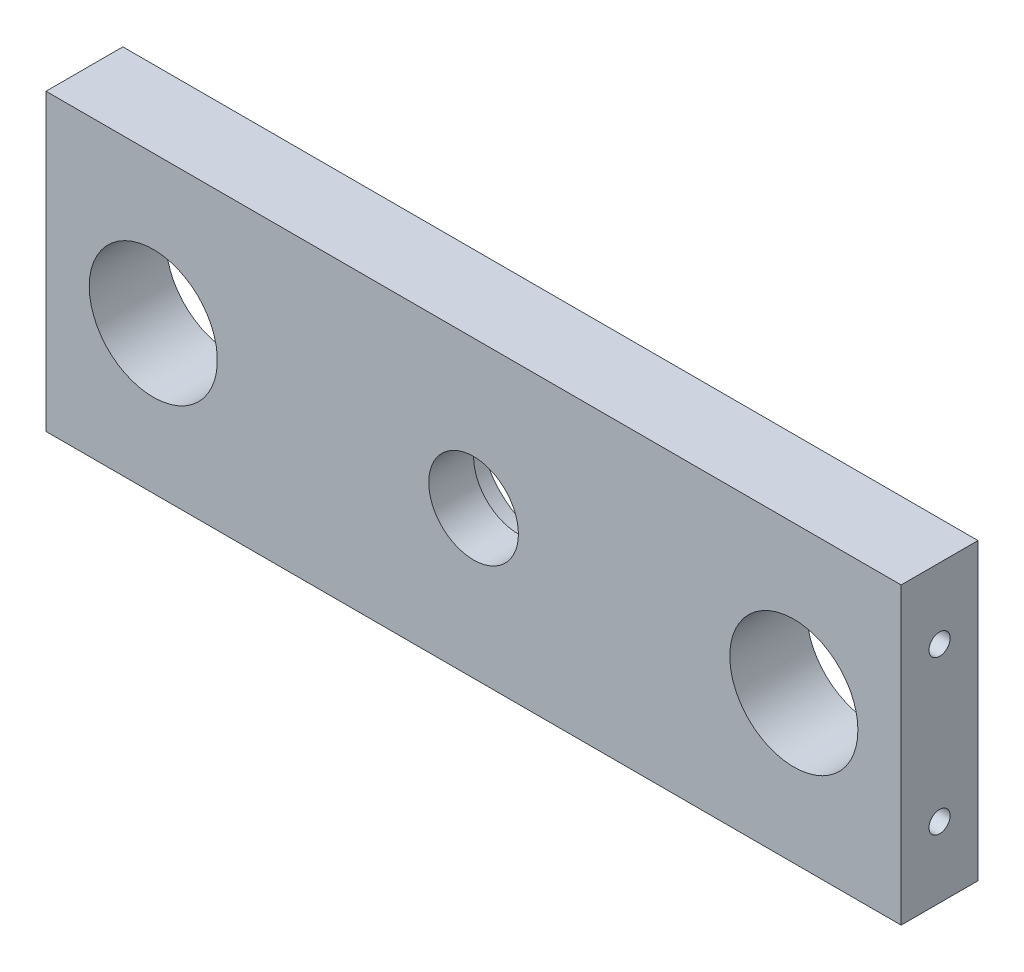
ISO-10303-21;
HEADER;
FILE_DESCRIPTION(('STEP AP214'),'2;1');
FILE_NAME('part.step','',(''),(''),'','','');
FILE_SCHEMA(('AUTOMOTIVE_DESIGN { 1 0 10303 214 1 1 1 1 }'));
ENDSEC;
DATA;
#1=APPLICATION_CONTEXT('core data for automotive mechanical design processes');
#2=APPLICATION_PROTOCOL_DEFINITION('international standard','automotive_design',2000,#1);
#3=PRODUCT_CONTEXT('',#1,'mechanical');
#4=PRODUCT('Part','Part','',(#3));
#5=PRODUCT_RELATED_PRODUCT_CATEGORY('part','',(#4));
#6=PRODUCT_DEFINITION_FORMATION('','',#4);
#7=PRODUCT_DEFINITION_CONTEXT('part definition',#1,'design');
#8=PRODUCT_DEFINITION('design','',#6,#7);
#9=PRODUCT_DEFINITION_SHAPE('','',#8);
#10=(LENGTH_UNIT() NAMED_UNIT(*) SI_UNIT(.MILLI.,.METRE.));
#11=(NAMED_UNIT(*) PLANE_ANGLE_UNIT() SI_UNIT($,.RADIAN.));
#12=(NAMED_UNIT(*) SI_UNIT($,.STERADIAN.) SOLID_ANGLE_UNIT());
#13=UNCERTAINTY_MEASURE_WITH_UNIT(LENGTH_MEASURE(1.E-05),#10,'distance_accuracy_value','');
#14=(GEOMETRIC_REPRESENTATION_CONTEXT(3) GLOBAL_UNCERTAINTY_ASSIGNED_CONTEXT((#13)) GLOBAL_UNIT_ASSIGNED_CONTEXT((#10,
#11,#12)) REPRESENTATION_CONTEXT('',''));
#15=CARTESIAN_POINT('',(0.,0.,0.));
#16=DIRECTION('',(0.,0.,1.));
#17=DIRECTION('',(1.,0.,0.));
#18=AXIS2_PLACEMENT_3D('',#15,#16,#17);
#19=CARTESIAN_POINT('',(0.,0.,12.));
#20=DIRECTION('',(0.,0.,-1.));
#21=DIRECTION('',(-1.,0.,0.));
#22=AXIS2_PLACEMENT_3D('',#19,#20,#21);
#23=CYLINDRICAL_SURFACE('',#22,7.);
#24=CARTESIAN_POINT('',(0.,0.,12.));
#25=DIRECTION('',(0.,0.,1.));
#26=DIRECTION('',(1.,0.,0.));
#27=AXIS2_PLACEMENT_3D('',#24,#25,#26);
#28=CIRCLE('',#27,7.);
#29=CARTESIAN_POINT('',(7.,0.,12.));
#30=VERTEX_POINT('',#29);
#31=EDGE_CURVE('E120',#30,#30,#28,.T.);
#32=ORIENTED_EDGE('',*,*,#31,.T.);
#33=EDGE_LOOP('',(#32));
#34=FACE_BOUND('',#33,.T.);
#35=CARTESIAN_POINT('',(0.,0.,5.));
#36=DIRECTION('',(0.,0.,-1.));
#37=DIRECTION('',(-1.,0.,0.));
#38=AXIS2_PLACEMENT_3D('',#35,#36,#37);
#39=CIRCLE('',#38,7.);
#40=CARTESIAN_POINT('',(-7.,0.,5.));
#41=VERTEX_POINT('',#40);
#42=EDGE_CURVE('E113',#41,#41,#39,.T.);
#43=ORIENTED_EDGE('',*,*,#42,.T.);
#44=EDGE_LOOP('',(#43));
#45=FACE_BOUND('',#44,.T.);
#46=ADVANCED_FACE('F41',(#34,#45),#23,.F.);
#47=CARTESIAN_POINT('',(0.,0.,12.));
#48=DIRECTION('',(0.,0.,1.));
#49=DIRECTION('',(1.,0.,0.));
#50=AXIS2_PLACEMENT_3D('',#47,#48,#49);
#51=PLANE('',#50);
#52=CARTESIAN_POINT('',(-50.,0.,12.));
#53=DIRECTION('',(0.,0.,1.));
#54=DIRECTION('',(-1.,0.,0.));
#55=AXIS2_PLACEMENT_3D('',#52,#53,#54);
#56=CIRCLE('',#55,10.);
#57=CARTESIAN_POINT('',(-60.,0.,12.));
#58=VERTEX_POINT('',#57);
#59=EDGE_CURVE('E124',#58,#58,#56,.T.);
#60=ORIENTED_EDGE('',*,*,#59,.F.);
#61=EDGE_LOOP('',(#60));
#62=FACE_BOUND('',#61,.T.);
#63=DIRECTION('',(0.,-1.,0.));
#64=VECTOR('',#63,1.);
#65=CARTESIAN_POINT('',(-66.75,23.,12.));
#66=LINE('',#65,#64);
#67=CARTESIAN_POINT('',(-66.75,23.,12.));
#68=VERTEX_POINT('',#67);
#69=CARTESIAN_POINT('',(-66.75,-23.,12.));
#70=VERTEX_POINT('',#69);
#71=EDGE_CURVE('E136',#68,#70,#66,.T.);
#72=ORIENTED_EDGE('',*,*,#71,.T.);
#73=DIRECTION('',(1.,0.,0.));
#74=VECTOR('',#73,1.);
#75=CARTESIAN_POINT('',(-66.75,-23.,12.));
#76=LINE('',#75,#74);
#77=CARTESIAN_POINT('',(66.75,-23.,12.));
#78=VERTEX_POINT('',#77);
#79=EDGE_CURVE('E139',#70,#78,#76,.T.);
#80=ORIENTED_EDGE('',*,*,#79,.T.);
#81=DIRECTION('',(0.,1.,0.));
#82=VECTOR('',#81,1.);
#83=CARTESIAN_POINT('',(66.75,23.,12.));
#84=LINE('',#83,#82);
#85=CARTESIAN_POINT('',(66.75,23.,12.));
#86=VERTEX_POINT('',#85);
#87=EDGE_CURVE('E142',#78,#86,#84,.T.);
#88=ORIENTED_EDGE('',*,*,#87,.T.);
#89=DIRECTION('',(-1.,0.,0.));
#90=VECTOR('',#89,1.);
#91=CARTESIAN_POINT('',(-66.75,23.,12.));
#92=LINE('',#91,#90);
#93=EDGE_CURVE('E144',#86,#68,#92,.T.);
#94=ORIENTED_EDGE('',*,*,#93,.T.);
#95=EDGE_LOOP('',(#72,#80,#88,#94));
#96=FACE_BOUND('',#95,.T.);
#97=CARTESIAN_POINT('',(50.,0.,12.));
#98=DIRECTION('',(0.,0.,1.));
#99=DIRECTION('',(1.,0.,0.));
#100=AXIS2_PLACEMENT_3D('',#97,#98,#99);
#101=CIRCLE('',#100,10.);
#102=CARTESIAN_POINT('',(60.,0.,12.));
#103=VERTEX_POINT('',#102);
#104=EDGE_CURVE('E130',#103,#103,#101,.T.);
#105=ORIENTED_EDGE('',*,*,#104,.F.);
#106=EDGE_LOOP('',(#105));
#107=FACE_BOUND('',#106,.T.);
#108=ORIENTED_EDGE('',*,*,#31,.F.);
#109=EDGE_LOOP('',(#108));
#110=FACE_BOUND('',#109,.T.);
#111=ADVANCED_FACE('F185',(#62,#96,#107,#110),#51,.T.);
#112=CARTESIAN_POINT('',(0.,0.,0.));
#113=DIRECTION('',(0.,0.,1.));
#114=DIRECTION('',(1.,0.,0.));
#115=AXIS2_PLACEMENT_3D('',#112,#113,#114);
#116=PLANE('',#115);
#117=CARTESIAN_POINT('',(0.,0.,0.));
#118=DIRECTION('',(0.,0.,-1.));
#119=DIRECTION('',(-1.,0.,0.));
#120=AXIS2_PLACEMENT_3D('',#117,#118,#119);
#121=CIRCLE('',#120,11.);
#122=CARTESIAN_POINT('',(-11.,0.,0.));
#123=VERTEX_POINT('',#122);
#124=EDGE_CURVE('E111',#123,#123,#121,.T.);
#125=ORIENTED_EDGE('',*,*,#124,.F.);
#126=EDGE_LOOP('',(#125));
#127=FACE_BOUND('',#126,.T.);
#128=DIRECTION('',(0.,-1.,0.));
#129=VECTOR('',#128,1.);
#130=CARTESIAN_POINT('',(-66.75,23.,0.));
#131=LINE('',#130,#129);
#132=CARTESIAN_POINT('',(-66.75,23.,0.));
#133=VERTEX_POINT('',#132);
#134=CARTESIAN_POINT('',(-66.75,-23.,0.));
#135=VERTEX_POINT('',#134);
#136=EDGE_CURVE('E133',#133,#135,#131,.T.);
#137=ORIENTED_EDGE('',*,*,#136,.F.);
#138=DIRECTION('',(-1.,0.,0.));
#139=VECTOR('',#138,1.);
#140=CARTESIAN_POINT('',(-66.75,23.,0.));
#141=LINE('',#140,#139);
#142=CARTESIAN_POINT('',(66.75,23.,0.));
#143=VERTEX_POINT('',#142);
#144=EDGE_CURVE('E140',#143,#133,#141,.T.);
#145=ORIENTED_EDGE('',*,*,#144,.F.);
#146=DIRECTION('',(0.,1.,0.));
#147=VECTOR('',#146,1.);
#148=CARTESIAN_POINT('',(66.75,23.,0.));
#149=LINE('',#148,#147);
#150=CARTESIAN_POINT('',(66.75,-23.,0.));
#151=VERTEX_POINT('',#150);
#152=EDGE_CURVE('E151',#151,#143,#149,.T.);
#153=ORIENTED_EDGE('',*,*,#152,.F.);
#154=DIRECTION('',(1.,0.,0.));
#155=VECTOR('',#154,1.);
#156=CARTESIAN_POINT('',(-66.75,-23.,0.));
#157=LINE('',#156,#155);
#158=EDGE_CURVE('E149',#135,#151,#157,.T.);
#159=ORIENTED_EDGE('',*,*,#158,.F.);
#160=EDGE_LOOP('',(#137,#145,#153,#159));
#161=FACE_BOUND('',#160,.T.);
#162=CARTESIAN_POINT('',(50.,0.,0.));
#163=DIRECTION('',(0.,0.,1.));
#164=DIRECTION('',(1.,0.,0.));
#165=AXIS2_PLACEMENT_3D('',#162,#163,#164);
#166=CIRCLE('',#165,10.);
#167=CARTESIAN_POINT('',(60.,0.,0.));
#168=VERTEX_POINT('',#167);
#169=EDGE_CURVE('E127',#168,#168,#166,.T.);
#170=ORIENTED_EDGE('',*,*,#169,.T.);
#171=EDGE_LOOP('',(#170));
#172=FACE_BOUND('',#171,.T.);
#173=CARTESIAN_POINT('',(-50.,0.,0.));
#174=DIRECTION('',(0.,0.,1.));
#175=DIRECTION('',(-1.,0.,0.));
#176=AXIS2_PLACEMENT_3D('',#173,#174,#175);
#177=CIRCLE('',#176,10.);
#178=CARTESIAN_POINT('',(-60.,0.,0.));
#179=VERTEX_POINT('',#178);
#180=EDGE_CURVE('E123',#179,#179,#177,.T.);
#181=ORIENTED_EDGE('',*,*,#180,.T.);
#182=EDGE_LOOP('',(#181));
#183=FACE_BOUND('',#182,.T.);
#184=ADVANCED_FACE('F190',(#127,#161,#172,#183),#116,.F.);
#185=CARTESIAN_POINT('',(-66.75,23.,12.));
#186=DIRECTION('',(1.,0.,0.));
#187=DIRECTION('',(0.,0.,-1.));
#188=AXIS2_PLACEMENT_3D('',#185,#186,#187);
#189=PLANE('',#188);
#190=CARTESIAN_POINT('',(-66.75,12.,6.));
#191=DIRECTION('',(-1.,0.,0.));
#192=DIRECTION('',(0.,0.,1.));
#193=AXIS2_PLACEMENT_3D('',#190,#191,#192);
#194=CIRCLE('',#193,1.65);
#195=CARTESIAN_POINT('',(-66.75,12.,7.65));
#196=VERTEX_POINT('',#195);
#197=EDGE_CURVE('E248',#196,#196,#194,.T.);
#198=ORIENTED_EDGE('',*,*,#197,.F.);
#199=EDGE_LOOP('',(#198));
#200=FACE_BOUND('',#199,.T.);
#201=CARTESIAN_POINT('',(-66.75,-12.,6.));
#202=DIRECTION('',(-1.,0.,0.));
#203=DIRECTION('',(0.,0.,1.));
#204=AXIS2_PLACEMENT_3D('',#201,#202,#203);
#205=CIRCLE('',#204,1.65);
#206=CARTESIAN_POINT('',(-66.75,-12.,7.65));
#207=VERTEX_POINT('',#206);
#208=EDGE_CURVE('E105',#207,#207,#205,.T.);
#209=ORIENTED_EDGE('',*,*,#208,.F.);
#210=EDGE_LOOP('',(#209));
#211=FACE_BOUND('',#210,.T.);
#212=ORIENTED_EDGE('',*,*,#136,.T.);
#213=DIRECTION('',(0.,0.,-1.));
#214=VECTOR('',#213,1.);
#215=CARTESIAN_POINT('',(-66.75,-23.,12.));
#216=LINE('',#215,#214);
#217=EDGE_CURVE('E162',#70,#135,#216,.T.);
#218=ORIENTED_EDGE('',*,*,#217,.F.);
#219=ORIENTED_EDGE('',*,*,#71,.F.);
#220=DIRECTION('',(0.,0.,-1.));
#221=VECTOR('',#220,1.);
#222=CARTESIAN_POINT('',(-66.75,23.,12.));
#223=LINE('',#222,#221);
#224=EDGE_CURVE('E146',#68,#133,#223,.T.);
#225=ORIENTED_EDGE('',*,*,#224,.T.);
#226=EDGE_LOOP('',(#212,#218,#219,#225));
#227=FACE_BOUND('',#226,.T.);
#228=ADVANCED_FACE('F43',(#200,#211,#227),#189,.F.);
#229=CARTESIAN_POINT('',(-66.75,-23.,12.));
#230=DIRECTION('',(0.,1.,0.));
#231=DIRECTION('',(0.,0.,1.));
#232=AXIS2_PLACEMENT_3D('',#229,#230,#231);
#233=PLANE('',#232);
#234=ORIENTED_EDGE('',*,*,#158,.T.);
#235=DIRECTION('',(0.,0.,-1.));
#236=VECTOR('',#235,1.);
#237=CARTESIAN_POINT('',(66.75,-23.,12.));
#238=LINE('',#237,#236);
#239=EDGE_CURVE('E159',#78,#151,#238,.T.);
#240=ORIENTED_EDGE('',*,*,#239,.F.);
#241=ORIENTED_EDGE('',*,*,#79,.F.);
#242=ORIENTED_EDGE('',*,*,#217,.T.);
#243=EDGE_LOOP('',(#234,#240,#241,#242));
#244=FACE_BOUND('',#243,.T.);
#245=ADVANCED_FACE('F211',(#244),#233,.F.);
#246=CARTESIAN_POINT('',(66.75,23.,12.));
#247=DIRECTION('',(-1.,0.,0.));
#248=DIRECTION('',(0.,0.,1.));
#249=AXIS2_PLACEMENT_3D('',#246,#247,#248);
#250=PLANE('',#249);
#251=CARTESIAN_POINT('',(66.75,12.,6.));
#252=DIRECTION('',(-1.,0.,0.));
#253=DIRECTION('',(0.,0.,1.));
#254=AXIS2_PLACEMENT_3D('',#251,#252,#253);
#255=CIRCLE('',#254,1.64999999999998);
#256=CARTESIAN_POINT('',(66.75,12.,7.64999999999998));
#257=VERTEX_POINT('',#256);
#258=EDGE_CURVE('E106',#257,#257,#255,.T.);
#259=ORIENTED_EDGE('',*,*,#258,.T.);
#260=EDGE_LOOP('',(#259));
#261=FACE_BOUND('',#260,.T.);
#262=CARTESIAN_POINT('',(66.75,-12.,6.));
#263=DIRECTION('',(-1.,0.,0.));
#264=DIRECTION('',(0.,0.,1.));
#265=AXIS2_PLACEMENT_3D('',#262,#263,#264);
#266=CIRCLE('',#265,1.64999999999998);
#267=CARTESIAN_POINT('',(66.75,-12.,7.64999999999998));
#268=VERTEX_POINT('',#267);
#269=EDGE_CURVE('E252',#268,#268,#266,.T.);
#270=ORIENTED_EDGE('',*,*,#269,.T.);
#271=EDGE_LOOP('',(#270));
#272=FACE_BOUND('',#271,.T.);
#273=ORIENTED_EDGE('',*,*,#152,.T.);
#274=DIRECTION('',(0.,0.,-1.));
#275=VECTOR('',#274,1.);
#276=CARTESIAN_POINT('',(66.75,23.,12.));
#277=LINE('',#276,#275);
#278=EDGE_CURVE('E156',#86,#143,#277,.T.);
#279=ORIENTED_EDGE('',*,*,#278,.F.);
#280=ORIENTED_EDGE('',*,*,#87,.F.);
#281=ORIENTED_EDGE('',*,*,#239,.T.);
#282=EDGE_LOOP('',(#273,#279,#280,#281));
#283=FACE_BOUND('',#282,.T.);
#284=ADVANCED_FACE('F208',(#261,#272,#283),#250,.F.);
#285=CARTESIAN_POINT('',(-66.75,23.,12.));
#286=DIRECTION('',(0.,-1.,0.));
#287=DIRECTION('',(0.,0.,-1.));
#288=AXIS2_PLACEMENT_3D('',#285,#286,#287);
#289=PLANE('',#288);
#290=ORIENTED_EDGE('',*,*,#144,.T.);
#291=ORIENTED_EDGE('',*,*,#224,.F.);
#292=ORIENTED_EDGE('',*,*,#93,.F.);
#293=ORIENTED_EDGE('',*,*,#278,.T.);
#294=EDGE_LOOP('',(#290,#291,#292,#293));
#295=FACE_BOUND('',#294,.T.);
#296=ADVANCED_FACE('F200',(#295),#289,.F.);
#297=CARTESIAN_POINT('',(50.,0.,12.));
#298=DIRECTION('',(0.,0.,-1.));
#299=DIRECTION('',(-1.,0.,0.));
#300=AXIS2_PLACEMENT_3D('',#297,#298,#299);
#301=CYLINDRICAL_SURFACE('',#300,10.);
#302=ORIENTED_EDGE('',*,*,#104,.T.);
#303=EDGE_LOOP('',(#302));
#304=FACE_BOUND('',#303,.T.);
#305=ORIENTED_EDGE('',*,*,#169,.F.);
#306=EDGE_LOOP('',(#305));
#307=FACE_BOUND('',#306,.T.);
#308=ADVANCED_FACE('F197',(#304,#307),#301,.F.);
#309=CARTESIAN_POINT('',(-50.,0.,12.));
#310=DIRECTION('',(0.,0.,-1.));
#311=DIRECTION('',(-1.,0.,0.));
#312=AXIS2_PLACEMENT_3D('',#309,#310,#311);
#313=CYLINDRICAL_SURFACE('',#312,10.);
#314=ORIENTED_EDGE('',*,*,#59,.T.);
#315=EDGE_LOOP('',(#314));
#316=FACE_BOUND('',#315,.T.);
#317=ORIENTED_EDGE('',*,*,#180,.F.);
#318=EDGE_LOOP('',(#317));
#319=FACE_BOUND('',#318,.T.);
#320=ADVANCED_FACE('F183',(#316,#319),#313,.F.);
#321=CARTESIAN_POINT('',(0.,0.,5.));
#322=DIRECTION('',(0.,0.,-1.));
#323=DIRECTION('',(-1.,0.,0.));
#324=AXIS2_PLACEMENT_3D('',#321,#322,#323);
#325=CYLINDRICAL_SURFACE('',#324,11.);
#326=CARTESIAN_POINT('',(0.,0.,5.));
#327=DIRECTION('',(0.,0.,-1.));
#328=DIRECTION('',(-1.,0.,0.));
#329=AXIS2_PLACEMENT_3D('',#326,#327,#328);
#330=CIRCLE('',#329,11.);
#331=CARTESIAN_POINT('',(2.60308881834174,10.6875595251593,5.));
#332=VERTEX_POINT('',#331);
#333=CARTESIAN_POINT('',(2.60308881834174,-10.6875595251593,5.));
#334=VERTEX_POINT('',#333);
#335=EDGE_CURVE('E67',#332,#334,#330,.T.);
#336=ORIENTED_EDGE('',*,*,#335,.F.);
#337=CARTESIAN_POINT('',(2.60308881834174,10.6875595251593,5.));
#338=CARTESIAN_POINT('',(2.52330815861234,10.7069972446162,4.97454740500393));
#339=CARTESIAN_POINT('',(2.44263059153163,10.7256950890086,4.95148729155404));
#340=CARTESIAN_POINT('',(2.27991844193866,10.7614529460738,4.9094533451391));
#341=CARTESIAN_POINT('',(2.19788487429885,10.7785141239158,4.89047659301841));
#342=CARTESIAN_POINT('',(2.03296477539008,10.8108330460227,4.85591452893193));
#343=CARTESIAN_POINT('',(1.95008053499146,10.8260946998812,4.84032180052999));
#344=CARTESIAN_POINT('',(1.78349936339225,10.8547812313113,4.8119849569938));
#345=CARTESIAN_POINT('',(1.69980226551639,10.8682057232796,4.79924143952796));
#346=CARTESIAN_POINT('',(1.44611342601287,10.9058773778601,4.76444737540945));
#347=CARTESIAN_POINT('',(1.27515972995245,10.927200722154,4.74615808567772));
#348=CARTESIAN_POINT('',(0.931706556630921,10.9618317196429,4.71734512684624));
#349=CARTESIAN_POINT('',(0.759206054597691,10.9751335878111,4.70682706106511));
#350=CARTESIAN_POINT('',(0.469314606676638,10.9906091323436,4.69474681750742));
#351=CARTESIAN_POINT('',(0.352107870156957,10.9949888935521,4.69138969645047));
#352=CARTESIAN_POINT('',(0.117558844878132,10.9999971982062,4.68755722730532));
#353=CARTESIAN_POINT('',(0.000216549671367449,11.0006255551997,4.68708202245382));
#354=CARTESIAN_POINT('',(-0.234471633067454,10.9981272403834,4.68898778858388));
#355=CARTESIAN_POINT('',(-0.351817484068892,10.9949984149532,4.69137039766602));
#356=CARTESIAN_POINT('',(-0.586250414865434,10.9849931368428,4.69911511298879));
#357=CARTESIAN_POINT('',(-0.703337499718894,10.978116758082,4.70447716046084));
#358=CARTESIAN_POINT('',(-0.936394947678795,10.9606908195071,4.71841480931259));
#359=CARTESIAN_POINT('',(-1.05236790474917,10.9501618010958,4.7269724596784));
#360=CARTESIAN_POINT('',(-1.28358524915633,10.9254712837706,4.747742366078));
#361=CARTESIAN_POINT('',(-1.39882974842342,10.9113103575354,4.75995404599564));
#362=CARTESIAN_POINT('',(-1.62813325834161,10.8794559205123,4.78866137397218));
#363=CARTESIAN_POINT('',(-1.7421937001082,10.8617673719684,4.80515101399476));
#364=CARTESIAN_POINT('',(-1.96883318588882,10.8229802507071,4.84333746487128));
#365=CARTESIAN_POINT('',(-2.08141277522532,10.8018829735591,4.86503229887909));
#366=CARTESIAN_POINT('',(-2.26227006076336,10.7650888831639,4.90549784550009));
#367=CARTESIAN_POINT('',(-2.33119317537493,10.7503690021259,4.92226912078502));
#368=CARTESIAN_POINT('',(-2.46798900492797,10.7197928603532,4.95878798303688));
#369=CARTESIAN_POINT('',(-2.53586169489598,10.703936572651,4.97853564064674));
#370=CARTESIAN_POINT('',(-2.60308881834174,10.6875595251593,5.));
#371=B_SPLINE_CURVE_WITH_KNOTS('',3,(#337,#338,#339,#340,#341,#342,#343,#344,#345,#346,#347,
#348,#349,#350,#351,#352,#353,#354,#355,#356,#357,#358,#359,#360,#361,#362,#363,#364,#365,#366,
#367,#368,#369,#370),.UNSPECIFIED.,.F.,.F.,(4,2,2,2,2,2,2,2,2,2,2,2,2,2,2,2,4),(0.,
0.257802328855021,0.515419740455526,0.772466724185268,1.0295675772245,1.54885076618989,
2.06850801169736,2.42042867991387,2.77236683911095,3.12450682590108,3.47663986707563,
3.8268238819811,4.17695271384641,4.52659245624197,4.876099620883,5.09336580519827,
5.31063714702797),.UNSPECIFIED.);
#372=CARTESIAN_POINT('',(-2.60308881834174,10.6875595251593,5.));
#373=VERTEX_POINT('',#372);
#374=EDGE_CURVE('E11',#332,#373,#371,.T.);
#375=ORIENTED_EDGE('',*,*,#374,.T.);
#376=CARTESIAN_POINT('',(-2.60308881834174,-10.6875595251593,5.));
#377=VERTEX_POINT('',#376);
#378=EDGE_CURVE('E104',#377,#373,#330,.T.);
#379=ORIENTED_EDGE('',*,*,#378,.F.);
#380=CARTESIAN_POINT('',(-2.60308881834174,-10.6875595251593,5.));
#381=CARTESIAN_POINT('',(-2.52330815861234,-10.7069972446162,4.97454740500393));
#382=CARTESIAN_POINT('',(-2.44263059153163,-10.7256950890086,4.95148729155404));
#383=CARTESIAN_POINT('',(-2.27991844193866,-10.7614529460738,4.9094533451391));
#384=CARTESIAN_POINT('',(-2.19788487429885,-10.7785141239158,4.89047659301841));
#385=CARTESIAN_POINT('',(-2.03296477539008,-10.8108330460227,4.85591452893193));
#386=CARTESIAN_POINT('',(-1.95008053499146,-10.8260946998812,4.84032180052999));
#387=CARTESIAN_POINT('',(-1.78349936339225,-10.8547812313113,4.8119849569938));
#388=CARTESIAN_POINT('',(-1.69980226551639,-10.8682057232796,4.79924143952796));
#389=CARTESIAN_POINT('',(-1.44611342601287,-10.9058773778601,4.76444737540945));
#390=CARTESIAN_POINT('',(-1.27515972995245,-10.927200722154,4.74615808567772));
#391=CARTESIAN_POINT('',(-0.931706556630921,-10.9618317196429,4.71734512684624));
#392=CARTESIAN_POINT('',(-0.759206054597691,-10.9751335878111,4.70682706106511));
#393=CARTESIAN_POINT('',(-0.469314606676638,-10.9906091323436,4.69474681750742));
#394=CARTESIAN_POINT('',(-0.352107870156957,-10.9949888935521,4.69138969645047));
#395=CARTESIAN_POINT('',(-0.117558844878132,-10.9999971982062,4.68755722730532));
#396=CARTESIAN_POINT('',(-0.000216549671367449,-11.0006255551997,4.68708202245382));
#397=CARTESIAN_POINT('',(0.234471633067454,-10.9981272403834,4.68898778858388));
#398=CARTESIAN_POINT('',(0.351817484068892,-10.9949984149532,4.69137039766602));
#399=CARTESIAN_POINT('',(0.586250414865434,-10.9849931368428,4.69911511298879));
#400=CARTESIAN_POINT('',(0.703337499718894,-10.978116758082,4.70447716046084));
#401=CARTESIAN_POINT('',(0.936394947678795,-10.9606908195071,4.71841480931259));
#402=CARTESIAN_POINT('',(1.05236790474917,-10.9501618010958,4.7269724596784));
#403=CARTESIAN_POINT('',(1.28358524915633,-10.9254712837706,4.747742366078));
#404=CARTESIAN_POINT('',(1.39882974842342,-10.9113103575354,4.75995404599564));
#405=CARTESIAN_POINT('',(1.62813325834161,-10.8794559205123,4.78866137397218));
#406=CARTESIAN_POINT('',(1.7421937001082,-10.8617673719684,4.80515101399476));
#407=CARTESIAN_POINT('',(1.96883318588882,-10.8229802507071,4.84333746487128));
#408=CARTESIAN_POINT('',(2.08141277522532,-10.8018829735591,4.86503229887909));
#409=CARTESIAN_POINT('',(2.26227006076336,-10.7650888831639,4.90549784550009));
#410=CARTESIAN_POINT('',(2.33119317537493,-10.7503690021259,4.92226912078502));
#411=CARTESIAN_POINT('',(2.46798900492797,-10.7197928603532,4.95878798303688));
#412=CARTESIAN_POINT('',(2.53586169489598,-10.703936572651,4.97853564064674));
#413=CARTESIAN_POINT('',(2.60308881834174,-10.6875595251593,5.));
#414=B_SPLINE_CURVE_WITH_KNOTS('',3,(#380,#381,#382,#383,#384,#385,#386,#387,#388,#389,#390,
#391,#392,#393,#394,#395,#396,#397,#398,#399,#400,#401,#402,#403,#404,#405,#406,#407,#408,#409,
#410,#411,#412,#413),.UNSPECIFIED.,.F.,.F.,(4,2,2,2,2,2,2,2,2,2,2,2,2,2,2,2,4),(0.,
0.257802328855021,0.515419740455526,0.772466724185268,1.0295675772245,1.54885076618989,
2.06850801169736,2.42042867991387,2.77236683911095,3.12450682590108,3.47663986707563,
3.8268238819811,4.17695271384641,4.52659245624197,4.876099620883,5.09336580519827,
5.31063714702797),.UNSPECIFIED.);
#415=EDGE_CURVE('E55',#377,#334,#414,.T.);
#416=ORIENTED_EDGE('',*,*,#415,.T.);
#417=EDGE_LOOP('',(#336,#375,#379,#416));
#418=FACE_BOUND('',#417,.T.);
#419=ORIENTED_EDGE('',*,*,#124,.T.);
#420=EDGE_LOOP('',(#419));
#421=FACE_BOUND('',#420,.T.);
#422=ADVANCED_FACE('F109',(#418,#421),#325,.F.);
#423=CARTESIAN_POINT('',(0.,0.,5.));
#424=DIRECTION('',(0.,0.,-1.));
#425=DIRECTION('',(-1.,0.,0.));
#426=AXIS2_PLACEMENT_3D('',#423,#424,#425);
#427=PLANE('',#426);
#428=DIRECTION('',(-1.,0.,0.));
#429=VECTOR('',#428,1.);
#430=CARTESIAN_POINT('',(-66.75,10.6875595251593,5.));
#431=LINE('',#430,#429);
#432=EDGE_CURVE('E61',#332,#373,#431,.T.);
#433=ORIENTED_EDGE('',*,*,#432,.F.);
#434=ORIENTED_EDGE('',*,*,#335,.T.);
#435=DIRECTION('',(-1.,0.,0.));
#436=VECTOR('',#435,1.);
#437=CARTESIAN_POINT('',(-66.75,-10.6875595251593,5.));
#438=LINE('',#437,#436);
#439=EDGE_CURVE('E115',#377,#334,#438,.F.);
#440=ORIENTED_EDGE('',*,*,#439,.F.);
#441=ORIENTED_EDGE('',*,*,#378,.T.);
#442=EDGE_LOOP('',(#433,#434,#440,#441));
#443=FACE_BOUND('',#442,.T.);
#444=ORIENTED_EDGE('',*,*,#42,.F.);
#445=EDGE_LOOP('',(#444));
#446=FACE_BOUND('',#445,.T.);
#447=ADVANCED_FACE('F102',(#443,#446),#427,.T.);
#448=CARTESIAN_POINT('',(-66.75,-12.,6.));
#449=DIRECTION('',(-1.,0.,0.));
#450=DIRECTION('',(0.,0.,1.));
#451=AXIS2_PLACEMENT_3D('',#448,#449,#450);
#452=CYLINDRICAL_SURFACE('',#451,1.64999999999999);
#453=ORIENTED_EDGE('',*,*,#439,.T.);
#454=ORIENTED_EDGE('',*,*,#415,.F.);
#455=EDGE_LOOP('',(#453,#454));
#456=FACE_BOUND('',#455,.T.);
#457=ORIENTED_EDGE('',*,*,#269,.F.);
#458=EDGE_LOOP('',(#457));
#459=FACE_BOUND('',#458,.T.);
#460=ORIENTED_EDGE('',*,*,#208,.T.);
#461=EDGE_LOOP('',(#460));
#462=FACE_BOUND('',#461,.T.);
#463=ADVANCED_FACE('F174',(#456,#459,#462),#452,.F.);
#464=CARTESIAN_POINT('',(-66.75,12.,6.));
#465=DIRECTION('',(-1.,0.,0.));
#466=DIRECTION('',(0.,0.,1.));
#467=AXIS2_PLACEMENT_3D('',#464,#465,#466);
#468=CYLINDRICAL_SURFACE('',#467,1.64999999999999);
#469=ORIENTED_EDGE('',*,*,#432,.T.);
#470=ORIENTED_EDGE('',*,*,#374,.F.);
#471=EDGE_LOOP('',(#469,#470));
#472=FACE_BOUND('',#471,.T.);
#473=ORIENTED_EDGE('',*,*,#258,.F.);
#474=EDGE_LOOP('',(#473));
#475=FACE_BOUND('',#474,.T.);
#476=ORIENTED_EDGE('',*,*,#197,.T.);
#477=EDGE_LOOP('',(#476));
#478=FACE_BOUND('',#477,.T.);
#479=ADVANCED_FACE('F97',(#472,#475,#478),#468,.F.);
#480=CLOSED_SHELL('',(#46,#111,#184,#228,#245,#284,#296,#308,#320,#422,#447,#463,#479));
#481=MANIFOLD_SOLID_BREP('B2',#480);
#482=ADVANCED_BREP_SHAPE_REPRESENTATION('',(#18,#481),#14);
#483=SHAPE_DEFINITION_REPRESENTATION(#9,#482);
ENDSEC;
END-ISO-10303-21;
